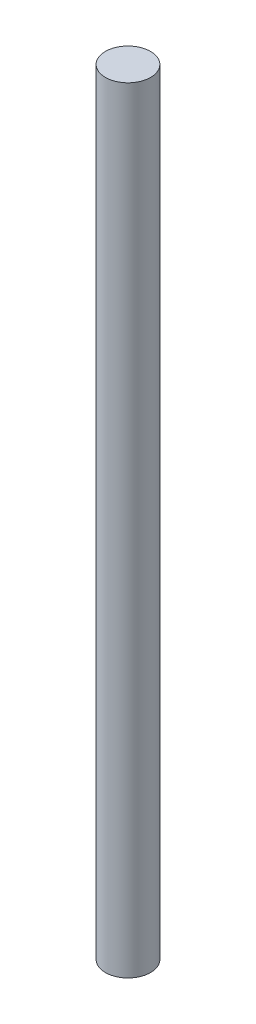
ISO-10303-21;
HEADER;
FILE_DESCRIPTION(('STEP AP214'),'2;1');
FILE_NAME('part.step','',(''),(''),'','','');
FILE_SCHEMA(('AUTOMOTIVE_DESIGN { 1 0 10303 214 1 1 1 1 }'));
ENDSEC;
DATA;
#1=APPLICATION_CONTEXT('core data for automotive mechanical design processes');
#2=APPLICATION_PROTOCOL_DEFINITION('international standard','automotive_design',2000,#1);
#3=PRODUCT_CONTEXT('',#1,'mechanical');
#4=PRODUCT('Part','Part','',(#3));
#5=PRODUCT_RELATED_PRODUCT_CATEGORY('part','',(#4));
#6=PRODUCT_DEFINITION_FORMATION('','',#4);
#7=PRODUCT_DEFINITION_CONTEXT('part definition',#1,'design');
#8=PRODUCT_DEFINITION('design','',#6,#7);
#9=PRODUCT_DEFINITION_SHAPE('','',#8);
#10=(LENGTH_UNIT() NAMED_UNIT(*) SI_UNIT(.MILLI.,.METRE.));
#11=(NAMED_UNIT(*) PLANE_ANGLE_UNIT() SI_UNIT($,.RADIAN.));
#12=(NAMED_UNIT(*) SI_UNIT($,.STERADIAN.) SOLID_ANGLE_UNIT());
#13=UNCERTAINTY_MEASURE_WITH_UNIT(LENGTH_MEASURE(1.E-05),#10,'distance_accuracy_value','');
#14=(GEOMETRIC_REPRESENTATION_CONTEXT(3) GLOBAL_UNCERTAINTY_ASSIGNED_CONTEXT((#13)) GLOBAL_UNIT_ASSIGNED_CONTEXT((#10,
#11,#12)) REPRESENTATION_CONTEXT('',''));
#15=CARTESIAN_POINT('',(0.,0.,0.));
#16=DIRECTION('',(0.,0.,1.));
#17=DIRECTION('',(1.,0.,0.));
#18=AXIS2_PLACEMENT_3D('',#15,#16,#17);
#19=CARTESIAN_POINT('',(0.,110.,0.));
#20=DIRECTION('',(0.,-1.,0.));
#21=DIRECTION('',(0.,0.,-1.));
#22=AXIS2_PLACEMENT_3D('',#19,#20,#21);
#23=CYLINDRICAL_SURFACE('',#22,3.2);
#24=CARTESIAN_POINT('',(0.,110.,0.));
#25=DIRECTION('',(0.,1.,0.));
#26=DIRECTION('',(0.,0.,1.));
#27=AXIS2_PLACEMENT_3D('',#24,#25,#26);
#28=CIRCLE('',#27,3.2);
#29=CARTESIAN_POINT('',(0.,110.,3.2));
#30=VERTEX_POINT('',#29);
#31=EDGE_CURVE('E10',#30,#30,#28,.T.);
#32=ORIENTED_EDGE('',*,*,#31,.F.);
#33=EDGE_LOOP('',(#32));
#34=FACE_BOUND('',#33,.T.);
#35=CARTESIAN_POINT('',(0.,0.,0.));
#36=DIRECTION('',(0.,1.,0.));
#37=DIRECTION('',(0.,0.,1.));
#38=AXIS2_PLACEMENT_3D('',#35,#36,#37);
#39=CIRCLE('',#38,3.2);
#40=CARTESIAN_POINT('',(0.,0.,3.2));
#41=VERTEX_POINT('',#40);
#42=EDGE_CURVE('E40',#41,#41,#39,.T.);
#43=ORIENTED_EDGE('',*,*,#42,.T.);
#44=EDGE_LOOP('',(#43));
#45=FACE_BOUND('',#44,.T.);
#46=ADVANCED_FACE('F37',(#34,#45),#23,.T.);
#47=CARTESIAN_POINT('',(0.,110.,0.));
#48=DIRECTION('',(0.,1.,0.));
#49=DIRECTION('',(0.,0.,1.));
#50=AXIS2_PLACEMENT_3D('',#47,#48,#49);
#51=PLANE('',#50);
#52=ORIENTED_EDGE('',*,*,#31,.T.);
#53=EDGE_LOOP('',(#52));
#54=FACE_BOUND('',#53,.T.);
#55=ADVANCED_FACE('F52',(#54),#51,.T.);
#56=CARTESIAN_POINT('',(0.,0.,0.));
#57=DIRECTION('',(0.,1.,0.));
#58=DIRECTION('',(0.,0.,1.));
#59=AXIS2_PLACEMENT_3D('',#56,#57,#58);
#60=PLANE('',#59);
#61=ORIENTED_EDGE('',*,*,#42,.F.);
#62=EDGE_LOOP('',(#61));
#63=FACE_BOUND('',#62,.T.);
#64=ADVANCED_FACE('F50',(#63),#60,.F.);
#65=CLOSED_SHELL('',(#46,#55,#64));
#66=MANIFOLD_SOLID_BREP('B2',#65);
#67=ADVANCED_BREP_SHAPE_REPRESENTATION('',(#18,#66),#14);
#68=SHAPE_DEFINITION_REPRESENTATION(#9,#67);
ENDSEC;
END-ISO-10303-21;
